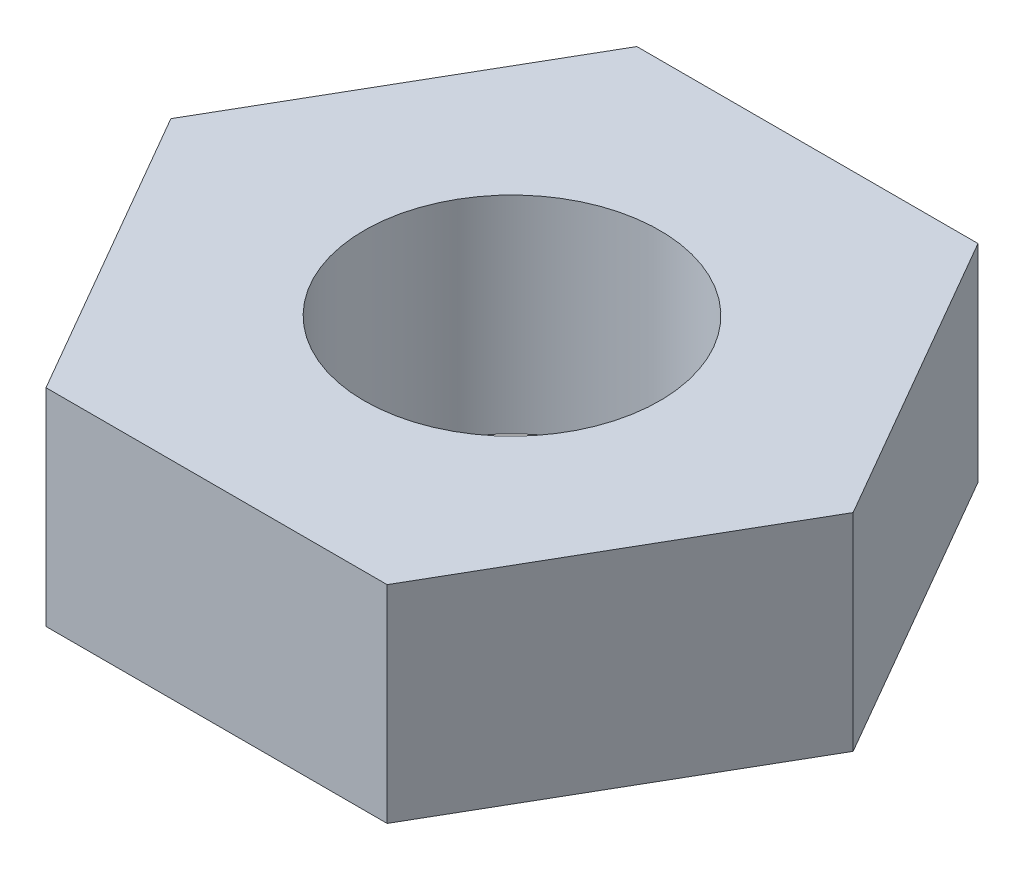
ISO-10303-21;
HEADER;
FILE_DESCRIPTION(('STEP AP214'),'2;1');
FILE_NAME('part.step','',(''),(''),'','','');
FILE_SCHEMA(('AUTOMOTIVE_DESIGN { 1 0 10303 214 1 1 1 1 }'));
ENDSEC;
DATA;
#1=APPLICATION_CONTEXT('core data for automotive mechanical design processes');
#2=APPLICATION_PROTOCOL_DEFINITION('international standard','automotive_design',2000,#1);
#3=PRODUCT_CONTEXT('',#1,'mechanical');
#4=PRODUCT('Part','Part','',(#3));
#5=PRODUCT_RELATED_PRODUCT_CATEGORY('part','',(#4));
#6=PRODUCT_DEFINITION_FORMATION('','',#4);
#7=PRODUCT_DEFINITION_CONTEXT('part definition',#1,'design');
#8=PRODUCT_DEFINITION('design','',#6,#7);
#9=PRODUCT_DEFINITION_SHAPE('','',#8);
#10=(LENGTH_UNIT() NAMED_UNIT(*) SI_UNIT(.MILLI.,.METRE.));
#11=(NAMED_UNIT(*) PLANE_ANGLE_UNIT() SI_UNIT($,.RADIAN.));
#12=(NAMED_UNIT(*) SI_UNIT($,.STERADIAN.) SOLID_ANGLE_UNIT());
#13=UNCERTAINTY_MEASURE_WITH_UNIT(LENGTH_MEASURE(1.E-05),#10,'distance_accuracy_value','');
#14=(GEOMETRIC_REPRESENTATION_CONTEXT(3) GLOBAL_UNCERTAINTY_ASSIGNED_CONTEXT((#13)) GLOBAL_UNIT_ASSIGNED_CONTEXT((#10,
#11,#12)) REPRESENTATION_CONTEXT('',''));
#15=CARTESIAN_POINT('',(0.,0.,0.));
#16=DIRECTION('',(0.,0.,1.));
#17=DIRECTION('',(1.,0.,0.));
#18=AXIS2_PLACEMENT_3D('',#15,#16,#17);
#19=CARTESIAN_POINT('',(0.,3.5,0.));
#20=DIRECTION('',(0.,1.,0.));
#21=DIRECTION('',(0.,0.,1.));
#22=AXIS2_PLACEMENT_3D('',#19,#20,#21);
#23=PLANE('',#22);
#24=DIRECTION('',(0.5,0.,-0.866025403784439));
#25=VECTOR('',#24,1.);
#26=CARTESIAN_POINT('',(2.88675134594813,3.5,5.));
#27=LINE('',#26,#25);
#28=CARTESIAN_POINT('',(2.88675134594813,3.5,5.));
#29=VERTEX_POINT('',#28);
#30=CARTESIAN_POINT('',(5.77350269189626,3.5,0.));
#31=VERTEX_POINT('',#30);
#32=EDGE_CURVE('E129',#29,#31,#27,.T.);
#33=ORIENTED_EDGE('',*,*,#32,.T.);
#34=DIRECTION('',(-0.5,0.,-0.866025403784438));
#35=VECTOR('',#34,1.);
#36=CARTESIAN_POINT('',(5.77350269189626,3.5,0.));
#37=LINE('',#36,#35);
#38=CARTESIAN_POINT('',(2.88675134594813,3.5,-5.));
#39=VERTEX_POINT('',#38);
#40=EDGE_CURVE('E87',#31,#39,#37,.T.);
#41=ORIENTED_EDGE('',*,*,#40,.T.);
#42=DIRECTION('',(-1.,0.,0.));
#43=VECTOR('',#42,1.);
#44=CARTESIAN_POINT('',(2.88675134594813,3.5,-5.));
#45=LINE('',#44,#43);
#46=CARTESIAN_POINT('',(-2.88675134594813,3.5,-5.));
#47=VERTEX_POINT('',#46);
#48=EDGE_CURVE('E100',#39,#47,#45,.T.);
#49=ORIENTED_EDGE('',*,*,#48,.T.);
#50=DIRECTION('',(-0.5,0.,0.866025403784439));
#51=VECTOR('',#50,1.);
#52=CARTESIAN_POINT('',(-2.88675134594813,3.5,-5.));
#53=LINE('',#52,#51);
#54=CARTESIAN_POINT('',(-5.77350269189626,3.5,0.));
#55=VERTEX_POINT('',#54);
#56=EDGE_CURVE('E94',#47,#55,#53,.T.);
#57=ORIENTED_EDGE('',*,*,#56,.T.);
#58=DIRECTION('',(0.5,0.,0.866025403784439));
#59=VECTOR('',#58,1.);
#60=CARTESIAN_POINT('',(-5.77350269189626,3.5,0.));
#61=LINE('',#60,#59);
#62=CARTESIAN_POINT('',(-2.88675134594813,3.5,5.));
#63=VERTEX_POINT('',#62);
#64=EDGE_CURVE('E98',#55,#63,#61,.T.);
#65=ORIENTED_EDGE('',*,*,#64,.T.);
#66=DIRECTION('',(1.,0.,0.));
#67=VECTOR('',#66,1.);
#68=CARTESIAN_POINT('',(-2.88675134594813,3.5,5.));
#69=LINE('',#68,#67);
#70=EDGE_CURVE('E50',#63,#29,#69,.T.);
#71=ORIENTED_EDGE('',*,*,#70,.T.);
#72=EDGE_LOOP('',(#33,#41,#49,#57,#65,#71));
#73=FACE_BOUND('',#72,.T.);
#74=CARTESIAN_POINT('',(0.,3.5,0.));
#75=DIRECTION('',(0.,1.,0.));
#76=DIRECTION('',(0.,0.,1.));
#77=AXIS2_PLACEMENT_3D('',#74,#75,#76);
#78=CIRCLE('',#77,2.5);
#79=CARTESIAN_POINT('',(0.,3.5,2.5));
#80=VERTEX_POINT('',#79);
#81=EDGE_CURVE('E122',#80,#80,#78,.T.);
#82=ORIENTED_EDGE('',*,*,#81,.F.);
#83=EDGE_LOOP('',(#82));
#84=FACE_BOUND('',#83,.T.);
#85=ADVANCED_FACE('F33',(#73,#84),#23,.T.);
#86=CARTESIAN_POINT('',(0.,0.,0.));
#87=DIRECTION('',(0.,1.,0.));
#88=DIRECTION('',(0.,0.,1.));
#89=AXIS2_PLACEMENT_3D('',#86,#87,#88);
#90=PLANE('',#89);
#91=DIRECTION('',(0.5,0.,-0.866025403784439));
#92=VECTOR('',#91,1.);
#93=CARTESIAN_POINT('',(2.88675134594813,0.,5.));
#94=LINE('',#93,#92);
#95=CARTESIAN_POINT('',(2.88675134594813,0.,5.));
#96=VERTEX_POINT('',#95);
#97=CARTESIAN_POINT('',(5.77350269189626,0.,0.));
#98=VERTEX_POINT('',#97);
#99=EDGE_CURVE('E118',#96,#98,#94,.T.);
#100=ORIENTED_EDGE('',*,*,#99,.F.);
#101=DIRECTION('',(1.,0.,0.));
#102=VECTOR('',#101,1.);
#103=CARTESIAN_POINT('',(-2.88675134594813,0.,5.));
#104=LINE('',#103,#102);
#105=CARTESIAN_POINT('',(-2.88675134594813,0.,5.));
#106=VERTEX_POINT('',#105);
#107=EDGE_CURVE('E79',#106,#96,#104,.T.);
#108=ORIENTED_EDGE('',*,*,#107,.F.);
#109=DIRECTION('',(0.5,0.,0.866025403784439));
#110=VECTOR('',#109,1.);
#111=CARTESIAN_POINT('',(-5.77350269189626,0.,0.));
#112=LINE('',#111,#110);
#113=CARTESIAN_POINT('',(-5.77350269189626,0.,0.));
#114=VERTEX_POINT('',#113);
#115=EDGE_CURVE('E73',#114,#106,#112,.T.);
#116=ORIENTED_EDGE('',*,*,#115,.F.);
#117=DIRECTION('',(-0.5,0.,0.866025403784439));
#118=VECTOR('',#117,1.);
#119=CARTESIAN_POINT('',(-2.88675134594813,0.,-5.));
#120=LINE('',#119,#118);
#121=CARTESIAN_POINT('',(-2.88675134594813,0.,-5.));
#122=VERTEX_POINT('',#121);
#123=EDGE_CURVE('E108',#122,#114,#120,.T.);
#124=ORIENTED_EDGE('',*,*,#123,.F.);
#125=DIRECTION('',(-1.,0.,0.));
#126=VECTOR('',#125,1.);
#127=CARTESIAN_POINT('',(2.88675134594813,0.,-5.));
#128=LINE('',#127,#126);
#129=CARTESIAN_POINT('',(2.88675134594813,0.,-5.));
#130=VERTEX_POINT('',#129);
#131=EDGE_CURVE('E124',#130,#122,#128,.T.);
#132=ORIENTED_EDGE('',*,*,#131,.F.);
#133=DIRECTION('',(-0.5,0.,-0.866025403784438));
#134=VECTOR('',#133,1.);
#135=CARTESIAN_POINT('',(5.77350269189626,0.,0.));
#136=LINE('',#135,#134);
#137=EDGE_CURVE('E121',#98,#130,#136,.T.);
#138=ORIENTED_EDGE('',*,*,#137,.F.);
#139=EDGE_LOOP('',(#100,#108,#116,#124,#132,#138));
#140=FACE_BOUND('',#139,.T.);
#141=CARTESIAN_POINT('',(0.,0.,0.));
#142=DIRECTION('',(0.,1.,0.));
#143=DIRECTION('',(0.,0.,1.));
#144=AXIS2_PLACEMENT_3D('',#141,#142,#143);
#145=CIRCLE('',#144,2.5);
#146=CARTESIAN_POINT('',(0.,0.,2.5));
#147=VERTEX_POINT('',#146);
#148=EDGE_CURVE('E222',#147,#147,#145,.T.);
#149=ORIENTED_EDGE('',*,*,#148,.T.);
#150=EDGE_LOOP('',(#149));
#151=FACE_BOUND('',#150,.T.);
#152=ADVANCED_FACE('F138',(#140,#151),#90,.F.);
#153=CARTESIAN_POINT('',(2.88675134594813,3.5,5.));
#154=DIRECTION('',(-0.866025403784439,0.,-0.5));
#155=DIRECTION('',(-0.5,0.,0.866025403784439));
#156=AXIS2_PLACEMENT_3D('',#153,#154,#155);
#157=PLANE('',#156);
#158=ORIENTED_EDGE('',*,*,#99,.T.);
#159=DIRECTION('',(0.,-1.,0.));
#160=VECTOR('',#159,1.);
#161=CARTESIAN_POINT('',(5.77350269189626,3.5,0.));
#162=LINE('',#161,#160);
#163=EDGE_CURVE('E11',#31,#98,#162,.T.);
#164=ORIENTED_EDGE('',*,*,#163,.F.);
#165=ORIENTED_EDGE('',*,*,#32,.F.);
#166=DIRECTION('',(0.,-1.,0.));
#167=VECTOR('',#166,1.);
#168=CARTESIAN_POINT('',(2.88675134594813,3.5,5.));
#169=LINE('',#168,#167);
#170=EDGE_CURVE('E114',#29,#96,#169,.T.);
#171=ORIENTED_EDGE('',*,*,#170,.T.);
#172=EDGE_LOOP('',(#158,#164,#165,#171));
#173=FACE_BOUND('',#172,.T.);
#174=ADVANCED_FACE('F35',(#173),#157,.F.);
#175=CARTESIAN_POINT('',(5.77350269189626,3.5,0.));
#176=DIRECTION('',(-0.866025403784438,0.,0.5));
#177=DIRECTION('',(0.5,0.,0.866025403784439));
#178=AXIS2_PLACEMENT_3D('',#175,#176,#177);
#179=PLANE('',#178);
#180=ORIENTED_EDGE('',*,*,#137,.T.);
#181=DIRECTION('',(0.,-1.,0.));
#182=VECTOR('',#181,1.);
#183=CARTESIAN_POINT('',(2.88675134594813,3.5,-5.));
#184=LINE('',#183,#182);
#185=EDGE_CURVE('E42',#39,#130,#184,.T.);
#186=ORIENTED_EDGE('',*,*,#185,.F.);
#187=ORIENTED_EDGE('',*,*,#40,.F.);
#188=ORIENTED_EDGE('',*,*,#163,.T.);
#189=EDGE_LOOP('',(#180,#186,#187,#188));
#190=FACE_BOUND('',#189,.T.);
#191=ADVANCED_FACE('F163',(#190),#179,.F.);
#192=CARTESIAN_POINT('',(2.88675134594813,3.5,-5.));
#193=DIRECTION('',(0.,0.,1.));
#194=DIRECTION('',(1.,0.,0.));
#195=AXIS2_PLACEMENT_3D('',#192,#193,#194);
#196=PLANE('',#195);
#197=ORIENTED_EDGE('',*,*,#131,.T.);
#198=DIRECTION('',(0.,-1.,0.));
#199=VECTOR('',#198,1.);
#200=CARTESIAN_POINT('',(-2.88675134594813,3.5,-5.));
#201=LINE('',#200,#199);
#202=EDGE_CURVE('E109',#47,#122,#201,.T.);
#203=ORIENTED_EDGE('',*,*,#202,.F.);
#204=ORIENTED_EDGE('',*,*,#48,.F.);
#205=ORIENTED_EDGE('',*,*,#185,.T.);
#206=EDGE_LOOP('',(#197,#203,#204,#205));
#207=FACE_BOUND('',#206,.T.);
#208=ADVANCED_FACE('F135',(#207),#196,.F.);
#209=CARTESIAN_POINT('',(-2.88675134594813,3.5,-5.));
#210=DIRECTION('',(0.866025403784439,0.,0.5));
#211=DIRECTION('',(0.5,0.,-0.866025403784439));
#212=AXIS2_PLACEMENT_3D('',#209,#210,#211);
#213=PLANE('',#212);
#214=ORIENTED_EDGE('',*,*,#123,.T.);
#215=DIRECTION('',(0.,-1.,0.));
#216=VECTOR('',#215,1.);
#217=CARTESIAN_POINT('',(-5.77350269189626,3.5,0.));
#218=LINE('',#217,#216);
#219=EDGE_CURVE('E105',#55,#114,#218,.T.);
#220=ORIENTED_EDGE('',*,*,#219,.F.);
#221=ORIENTED_EDGE('',*,*,#56,.F.);
#222=ORIENTED_EDGE('',*,*,#202,.T.);
#223=EDGE_LOOP('',(#214,#220,#221,#222));
#224=FACE_BOUND('',#223,.T.);
#225=ADVANCED_FACE('F106',(#224),#213,.F.);
#226=CARTESIAN_POINT('',(-5.77350269189626,3.5,0.));
#227=DIRECTION('',(0.866025403784439,0.,-0.5));
#228=DIRECTION('',(-0.5,0.,-0.866025403784439));
#229=AXIS2_PLACEMENT_3D('',#226,#227,#228);
#230=PLANE('',#229);
#231=ORIENTED_EDGE('',*,*,#115,.T.);
#232=DIRECTION('',(0.,-1.,0.));
#233=VECTOR('',#232,1.);
#234=CARTESIAN_POINT('',(-2.88675134594813,3.5,5.));
#235=LINE('',#234,#233);
#236=EDGE_CURVE('E110',#63,#106,#235,.T.);
#237=ORIENTED_EDGE('',*,*,#236,.F.);
#238=ORIENTED_EDGE('',*,*,#64,.F.);
#239=ORIENTED_EDGE('',*,*,#219,.T.);
#240=EDGE_LOOP('',(#231,#237,#238,#239));
#241=FACE_BOUND('',#240,.T.);
#242=ADVANCED_FACE('F112',(#241),#230,.F.);
#243=CARTESIAN_POINT('',(-2.88675134594813,3.5,5.));
#244=DIRECTION('',(0.,0.,-1.));
#245=DIRECTION('',(-1.,0.,0.));
#246=AXIS2_PLACEMENT_3D('',#243,#244,#245);
#247=PLANE('',#246);
#248=ORIENTED_EDGE('',*,*,#107,.T.);
#249=ORIENTED_EDGE('',*,*,#170,.F.);
#250=ORIENTED_EDGE('',*,*,#70,.F.);
#251=ORIENTED_EDGE('',*,*,#236,.T.);
#252=EDGE_LOOP('',(#248,#249,#250,#251));
#253=FACE_BOUND('',#252,.T.);
#254=ADVANCED_FACE('F143',(#253),#247,.F.);
#255=CARTESIAN_POINT('',(0.,3.5,0.));
#256=DIRECTION('',(0.,-1.,0.));
#257=DIRECTION('',(0.,0.,-1.));
#258=AXIS2_PLACEMENT_3D('',#255,#256,#257);
#259=CYLINDRICAL_SURFACE('',#258,2.5);
#260=ORIENTED_EDGE('',*,*,#81,.T.);
#261=EDGE_LOOP('',(#260));
#262=FACE_BOUND('',#261,.T.);
#263=ORIENTED_EDGE('',*,*,#148,.F.);
#264=EDGE_LOOP('',(#263));
#265=FACE_BOUND('',#264,.T.);
#266=ADVANCED_FACE('F145',(#262,#265),#259,.F.);
#267=CLOSED_SHELL('',(#85,#152,#174,#191,#208,#225,#242,#254,#266));
#268=MANIFOLD_SOLID_BREP('B2',#267);
#269=ADVANCED_BREP_SHAPE_REPRESENTATION('',(#18,#268),#14);
#270=SHAPE_DEFINITION_REPRESENTATION(#9,#269);
ENDSEC;
END-ISO-10303-21;
